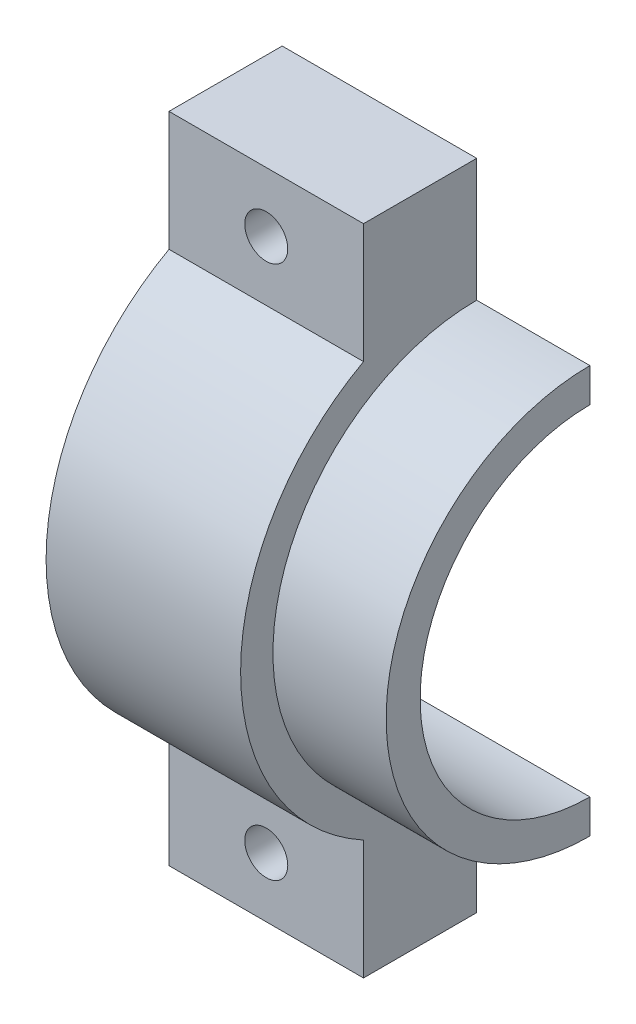
ISO-10303-21;
HEADER;
FILE_DESCRIPTION(('STEP AP214'),'2;1');
FILE_NAME('part.step','',(''),(''),'','','');
FILE_SCHEMA(('AUTOMOTIVE_DESIGN { 1 0 10303 214 1 1 1 1 }'));
ENDSEC;
DATA;
#1=APPLICATION_CONTEXT('core data for automotive mechanical design processes');
#2=APPLICATION_PROTOCOL_DEFINITION('international standard','automotive_design',2000,#1);
#3=PRODUCT_CONTEXT('',#1,'mechanical');
#4=PRODUCT('Part','Part','',(#3));
#5=PRODUCT_RELATED_PRODUCT_CATEGORY('part','',(#4));
#6=PRODUCT_DEFINITION_FORMATION('','',#4);
#7=PRODUCT_DEFINITION_CONTEXT('part definition',#1,'design');
#8=PRODUCT_DEFINITION('design','',#6,#7);
#9=PRODUCT_DEFINITION_SHAPE('','',#8);
#10=(LENGTH_UNIT() NAMED_UNIT(*) SI_UNIT(.MILLI.,.METRE.));
#11=(NAMED_UNIT(*) PLANE_ANGLE_UNIT() SI_UNIT($,.RADIAN.));
#12=(NAMED_UNIT(*) SI_UNIT($,.STERADIAN.) SOLID_ANGLE_UNIT());
#13=UNCERTAINTY_MEASURE_WITH_UNIT(LENGTH_MEASURE(1.E-05),#10,'distance_accuracy_value','');
#14=(GEOMETRIC_REPRESENTATION_CONTEXT(3) GLOBAL_UNCERTAINTY_ASSIGNED_CONTEXT((#13)) GLOBAL_UNIT_ASSIGNED_CONTEXT((#10,
#11,#12)) REPRESENTATION_CONTEXT('',''));
#15=CARTESIAN_POINT('',(0.,0.,0.));
#16=DIRECTION('',(0.,0.,1.));
#17=DIRECTION('',(1.,0.,0.));
#18=AXIS2_PLACEMENT_3D('',#15,#16,#17);
#19=CARTESIAN_POINT('',(0.,0.,163.846851175087));
#20=DIRECTION('',(0.,0.,1.));
#21=DIRECTION('',(1.,0.,0.));
#22=AXIS2_PLACEMENT_3D('',#19,#20,#21);
#23=PLANE('',#22);
#24=DIRECTION('',(0.,-1.,0.));
#25=VECTOR('',#24,1.);
#26=CARTESIAN_POINT('',(-13.7259035903398,0.,163.846851175087));
#27=LINE('',#26,#25);
#28=CARTESIAN_POINT('',(-13.7259035903398,-13.6244623370826,163.846851175087));
#29=VERTEX_POINT('',#28);
#30=CARTESIAN_POINT('',(-13.7259035903398,-17.4344623370826,163.846851175087));
#31=VERTEX_POINT('',#30);
#32=EDGE_CURVE('E46',#29,#31,#27,.T.);
#33=ORIENTED_EDGE('',*,*,#32,.T.);
#34=DIRECTION('',(1.,0.,0.));
#35=VECTOR('',#34,1.);
#36=CARTESIAN_POINT('',(-44.2059035903398,-17.4344623370826,163.846851175087));
#37=LINE('',#36,#35);
#38=CARTESIAN_POINT('',(-44.2059035903398,-17.4344623370826,163.846851175087));
#39=VERTEX_POINT('',#38);
#40=EDGE_CURVE('E308',#39,#31,#37,.T.);
#41=ORIENTED_EDGE('',*,*,#40,.F.);
#42=DIRECTION('',(0.,-1.,0.));
#43=VECTOR('',#42,1.);
#44=CARTESIAN_POINT('',(-44.2059035903398,-36.4844623370826,163.846851175087));
#45=LINE('',#44,#43);
#46=CARTESIAN_POINT('',(-44.2059035903398,-21.9969623370826,163.846851175087));
#47=VERTEX_POINT('',#46);
#48=EDGE_CURVE('E242',#39,#47,#45,.T.);
#49=ORIENTED_EDGE('',*,*,#48,.T.);
#50=DIRECTION('',(-1.,0.,0.));
#51=VECTOR('',#50,1.);
#52=CARTESIAN_POINT('',(-48.2509035903399,-21.9969623370826,163.846851175087));
#53=LINE('',#52,#51);
#54=CARTESIAN_POINT('',(-50.1959728523399,-21.9969623370826,163.846851175087));
#55=VERTEX_POINT('',#54);
#56=EDGE_CURVE('E320',#55,#47,#53,.F.);
#57=ORIENTED_EDGE('',*,*,#56,.F.);
#58=DIRECTION('',(0.,1.,0.));
#59=VECTOR('',#58,1.);
#60=CARTESIAN_POINT('',(-50.1959728523399,-36.4844623370826,163.846851175087));
#61=LINE('',#60,#59);
#62=CARTESIAN_POINT('',(-50.1959728523399,-18.7044623370826,163.846851175087));
#63=VERTEX_POINT('',#62);
#64=EDGE_CURVE('E248',#55,#63,#61,.T.);
#65=ORIENTED_EDGE('',*,*,#64,.T.);
#66=DIRECTION('',(1.,0.,0.));
#67=VECTOR('',#66,1.);
#68=CARTESIAN_POINT('',(-50.1959728523399,-18.7044623370826,163.846851175087));
#69=LINE('',#68,#67);
#70=CARTESIAN_POINT('',(-48.2509035903399,-18.7044623370826,163.846851175087));
#71=VERTEX_POINT('',#70);
#72=EDGE_CURVE('E161',#71,#63,#69,.F.);
#73=ORIENTED_EDGE('',*,*,#72,.F.);
#74=DIRECTION('',(0.,-1.,0.));
#75=VECTOR('',#74,1.);
#76=CARTESIAN_POINT('',(-48.2509035903399,-36.4844623370826,163.846851175087));
#77=LINE('',#76,#75);
#78=CARTESIAN_POINT('',(-48.2509035903399,0.163037662917389,163.846851175087));
#79=VERTEX_POINT('',#78);
#80=EDGE_CURVE('E332',#79,#71,#77,.T.);
#81=ORIENTED_EDGE('',*,*,#80,.F.);
#82=DIRECTION('',(1.,0.,0.));
#83=VECTOR('',#82,1.);
#84=CARTESIAN_POINT('',(-76.9703337735102,0.163037662917389,163.846851175087));
#85=LINE('',#84,#83);
#86=CARTESIAN_POINT('',(-26.4259035903398,0.163037662917389,163.846851175087));
#87=VERTEX_POINT('',#86);
#88=EDGE_CURVE('E255',#79,#87,#85,.T.);
#89=ORIENTED_EDGE('',*,*,#88,.T.);
#90=DIRECTION('',(0.,-1.,0.));
#91=VECTOR('',#90,1.);
#92=CARTESIAN_POINT('',(-26.4259035903398,-36.4844623370826,163.846851175087));
#93=LINE('',#92,#91);
#94=CARTESIAN_POINT('',(-26.4259035903398,-13.6244623370826,163.846851175087));
#95=VERTEX_POINT('',#94);
#96=EDGE_CURVE('E154',#87,#95,#93,.T.);
#97=ORIENTED_EDGE('',*,*,#96,.T.);
#98=DIRECTION('',(-1.,0.,0.));
#99=VECTOR('',#98,1.);
#100=CARTESIAN_POINT('',(-1.02590359033981,-13.6244623370826,163.846851175087));
#101=LINE('',#100,#99);
#102=EDGE_CURVE('E148',#29,#95,#101,.T.);
#103=ORIENTED_EDGE('',*,*,#102,.F.);
#104=EDGE_LOOP('',(#33,#41,#49,#57,#65,#73,#81,#89,#97,#103));
#105=FACE_BOUND('',#104,.T.);
#106=CARTESIAN_POINT('',(-37.3384035903399,-6.53856046823749,163.846851175087));
#107=DIRECTION('',(0.,0.,1.));
#108=DIRECTION('',(1.,0.,0.));
#109=AXIS2_PLACEMENT_3D('',#106,#107,#108);
#110=CIRCLE('',#109,2.413);
#111=CARTESIAN_POINT('',(-34.9254035903399,-6.53856046823749,163.846851175087));
#112=VERTEX_POINT('',#111);
#113=EDGE_CURVE('E224',#112,#112,#110,.F.);
#114=ORIENTED_EDGE('',*,*,#113,.F.);
#115=EDGE_LOOP('',(#114));
#116=FACE_BOUND('',#115,.T.);
#117=ADVANCED_FACE('F43',(#105,#116),#23,.F.);
#118=CARTESIAN_POINT('',(-37.3384035903399,-66.4303641739277,163.846851175087));
#119=DIRECTION('',(0.,0.,1.));
#120=DIRECTION('',(1.,0.,0.));
#121=AXIS2_PLACEMENT_3D('',#118,#119,#120);
#122=CIRCLE('',#121,2.413);
#123=CARTESIAN_POINT('',(-34.9254035903399,-66.4303641739277,163.846851175087));
#124=VERTEX_POINT('',#123);
#125=EDGE_CURVE('E171',#124,#124,#122,.T.);
#126=ORIENTED_EDGE('',*,*,#125,.T.);
#127=EDGE_LOOP('',(#126));
#128=FACE_BOUND('',#127,.T.);
#129=DIRECTION('',(0.,-1.,0.));
#130=VECTOR('',#129,1.);
#131=CARTESIAN_POINT('',(-13.7259035903398,0.,163.846851175087));
#132=LINE('',#131,#130);
#133=CARTESIAN_POINT('',(-13.7259035903398,-55.5344623370826,163.846851175087));
#134=VERTEX_POINT('',#133);
#135=CARTESIAN_POINT('',(-13.7259035903398,-59.3444623370826,163.846851175087));
#136=VERTEX_POINT('',#135);
#137=EDGE_CURVE('E252',#134,#136,#132,.T.);
#138=ORIENTED_EDGE('',*,*,#137,.T.);
#139=DIRECTION('',(-1.,0.,0.));
#140=VECTOR('',#139,1.);
#141=CARTESIAN_POINT('',(-1.02590359033981,-59.3444623370826,163.846851175087));
#142=LINE('',#141,#140);
#143=CARTESIAN_POINT('',(-26.4259035903398,-59.3444623370826,163.846851175087));
#144=VERTEX_POINT('',#143);
#145=EDGE_CURVE('E160',#144,#136,#142,.F.);
#146=ORIENTED_EDGE('',*,*,#145,.F.);
#147=CARTESIAN_POINT('',(-26.4259035903398,-73.1319623370826,163.846851175087));
#148=VERTEX_POINT('',#147);
#149=EDGE_CURVE('E238',#144,#148,#93,.T.);
#150=ORIENTED_EDGE('',*,*,#149,.T.);
#151=DIRECTION('',(-1.,0.,0.));
#152=VECTOR('',#151,1.);
#153=CARTESIAN_POINT('',(-76.9703337735102,-73.1319623370826,163.846851175087));
#154=LINE('',#153,#152);
#155=CARTESIAN_POINT('',(-48.2509035903399,-73.1319623370826,163.846851175087));
#156=VERTEX_POINT('',#155);
#157=EDGE_CURVE('E258',#148,#156,#154,.T.);
#158=ORIENTED_EDGE('',*,*,#157,.T.);
#159=CARTESIAN_POINT('',(-48.2509035903399,-54.2644623370826,163.846851175087));
#160=VERTEX_POINT('',#159);
#161=EDGE_CURVE('E325',#160,#156,#77,.T.);
#162=ORIENTED_EDGE('',*,*,#161,.F.);
#163=DIRECTION('',(1.,0.,0.));
#164=VECTOR('',#163,1.);
#165=CARTESIAN_POINT('',(-50.1959728523399,-54.2644623370826,163.846851175087));
#166=LINE('',#165,#164);
#167=CARTESIAN_POINT('',(-50.1959728523399,-54.2644623370826,163.846851175087));
#168=VERTEX_POINT('',#167);
#169=EDGE_CURVE('E319',#168,#160,#166,.T.);
#170=ORIENTED_EDGE('',*,*,#169,.F.);
#171=CARTESIAN_POINT('',(-50.1959728523399,-50.9719623370826,163.846851175087));
#172=VERTEX_POINT('',#171);
#173=EDGE_CURVE('E247',#168,#172,#61,.T.);
#174=ORIENTED_EDGE('',*,*,#173,.T.);
#175=DIRECTION('',(-1.,0.,0.));
#176=VECTOR('',#175,1.);
#177=CARTESIAN_POINT('',(-48.2509035903399,-50.9719623370826,163.846851175087));
#178=LINE('',#177,#176);
#179=CARTESIAN_POINT('',(-44.2059035903398,-50.9719623370826,163.846851175087));
#180=VERTEX_POINT('',#179);
#181=EDGE_CURVE('E313',#180,#172,#178,.T.);
#182=ORIENTED_EDGE('',*,*,#181,.F.);
#183=CARTESIAN_POINT('',(-44.2059035903398,-55.5344623370826,163.846851175087));
#184=VERTEX_POINT('',#183);
#185=EDGE_CURVE('E243',#180,#184,#45,.T.);
#186=ORIENTED_EDGE('',*,*,#185,.T.);
#187=DIRECTION('',(1.,0.,0.));
#188=VECTOR('',#187,1.);
#189=CARTESIAN_POINT('',(-44.2059035903398,-55.5344623370826,163.846851175087));
#190=LINE('',#189,#188);
#191=EDGE_CURVE('E309',#134,#184,#190,.F.);
#192=ORIENTED_EDGE('',*,*,#191,.F.);
#193=EDGE_LOOP('',(#138,#146,#150,#158,#162,#170,#174,#182,#186,#192));
#194=FACE_BOUND('',#193,.T.);
#195=ADVANCED_FACE('F265',(#128,#194),#23,.F.);
#196=CARTESIAN_POINT('',(-48.2509035903399,-36.4844623370826,163.846851175087));
#197=DIRECTION('',(1.,0.,0.));
#198=DIRECTION('',(0.,0.,-1.));
#199=AXIS2_PLACEMENT_3D('',#196,#197,#198);
#200=CYLINDRICAL_SURFACE('',#199,26.4875);
#201=CARTESIAN_POINT('',(-48.2509035903399,-36.4844623370826,163.846851175087));
#202=DIRECTION('',(1.,0.,0.));
#203=DIRECTION('',(0.,0.,-1.));
#204=AXIS2_PLACEMENT_3D('',#201,#202,#203);
#205=CIRCLE('',#204,26.4875);
#206=CARTESIAN_POINT('',(-48.2509035903399,-13.2401585993924,176.546851175087));
#207=VERTEX_POINT('',#206);
#208=CARTESIAN_POINT('',(-48.2509035903399,-59.7287660747728,176.546851175087));
#209=VERTEX_POINT('',#208);
#210=EDGE_CURVE('E285',#207,#209,#205,.T.);
#211=ORIENTED_EDGE('',*,*,#210,.T.);
#212=DIRECTION('',(1.,0.,0.));
#213=VECTOR('',#212,1.);
#214=CARTESIAN_POINT('',(-76.9703337735102,-59.7287660747728,176.546851175087));
#215=LINE('',#214,#213);
#216=CARTESIAN_POINT('',(-26.4259035903398,-59.7287660747728,176.546851175087));
#217=VERTEX_POINT('',#216);
#218=EDGE_CURVE('E204',#209,#217,#215,.T.);
#219=ORIENTED_EDGE('',*,*,#218,.T.);
#220=CARTESIAN_POINT('',(-26.4259035903398,-36.4844623370826,163.846851175087));
#221=DIRECTION('',(1.,0.,0.));
#222=DIRECTION('',(0.,0.,-1.));
#223=AXIS2_PLACEMENT_3D('',#220,#221,#222);
#224=CIRCLE('',#223,26.4875);
#225=CARTESIAN_POINT('',(-26.4259035903398,-13.2401585993924,176.546851175087));
#226=VERTEX_POINT('',#225);
#227=EDGE_CURVE('E283',#226,#217,#224,.T.);
#228=ORIENTED_EDGE('',*,*,#227,.F.);
#229=DIRECTION('',(1.,0.,0.));
#230=VECTOR('',#229,1.);
#231=CARTESIAN_POINT('',(-76.9703337735102,-13.2401585993924,176.546851175087));
#232=LINE('',#231,#230);
#233=EDGE_CURVE('E188',#207,#226,#232,.T.);
#234=ORIENTED_EDGE('',*,*,#233,.F.);
#235=EDGE_LOOP('',(#211,#219,#228,#234));
#236=FACE_BOUND('',#235,.T.);
#237=ADVANCED_FACE('F282',(#236),#200,.T.);
#238=CARTESIAN_POINT('',(-48.2509035903399,-36.4844623370826,163.846851175087));
#239=DIRECTION('',(-1.,0.,0.));
#240=DIRECTION('',(0.,0.,1.));
#241=AXIS2_PLACEMENT_3D('',#238,#239,#240);
#242=CYLINDRICAL_SURFACE('',#241,14.4875);
#243=CARTESIAN_POINT('',(-50.1959728523399,-36.4844623370826,163.846851175087));
#244=DIRECTION('',(-1.,0.,0.));
#245=DIRECTION('',(0.,0.,1.));
#246=AXIS2_PLACEMENT_3D('',#243,#244,#245);
#247=CIRCLE('',#246,14.4875);
#248=EDGE_CURVE('E229',#172,#55,#247,.T.);
#249=ORIENTED_EDGE('',*,*,#248,.T.);
#250=ORIENTED_EDGE('',*,*,#56,.T.);
#251=CARTESIAN_POINT('',(-44.2059035903398,-36.4844623370826,163.846851175087));
#252=DIRECTION('',(1.,0.,0.));
#253=DIRECTION('',(0.,0.,-1.));
#254=AXIS2_PLACEMENT_3D('',#251,#252,#253);
#255=CIRCLE('',#254,14.4875);
#256=EDGE_CURVE('E290',#180,#47,#255,.F.);
#257=ORIENTED_EDGE('',*,*,#256,.F.);
#258=ORIENTED_EDGE('',*,*,#181,.T.);
#259=EDGE_LOOP('',(#249,#250,#257,#258));
#260=FACE_BOUND('',#259,.T.);
#261=ADVANCED_FACE('F322',(#260),#242,.F.);
#262=CARTESIAN_POINT('',(-76.9703337735102,0.,176.546851175087));
#263=DIRECTION('',(0.,0.,-1.));
#264=DIRECTION('',(-1.,0.,0.));
#265=AXIS2_PLACEMENT_3D('',#262,#263,#264);
#266=PLANE('',#265);
#267=CARTESIAN_POINT('',(-37.3384035903399,-6.53856046823749,176.546851175087));
#268=DIRECTION('',(0.,0.,1.));
#269=DIRECTION('',(1.,0.,0.));
#270=AXIS2_PLACEMENT_3D('',#267,#268,#269);
#271=CIRCLE('',#270,2.413);
#272=CARTESIAN_POINT('',(-34.9254035903399,-6.53856046823749,176.546851175087));
#273=VERTEX_POINT('',#272);
#274=EDGE_CURVE('E52',#273,#273,#271,.T.);
#275=ORIENTED_EDGE('',*,*,#274,.F.);
#276=EDGE_LOOP('',(#275));
#277=FACE_BOUND('',#276,.T.);
#278=DIRECTION('',(1.,0.,0.));
#279=VECTOR('',#278,1.);
#280=CARTESIAN_POINT('',(-76.9703337735102,0.163037662917388,176.546851175087));
#281=LINE('',#280,#279);
#282=CARTESIAN_POINT('',(-48.2509035903399,0.163037662917388,176.546851175087));
#283=VERTEX_POINT('',#282);
#284=CARTESIAN_POINT('',(-26.4259035903398,0.163037662917388,176.546851175087));
#285=VERTEX_POINT('',#284);
#286=EDGE_CURVE('E193',#283,#285,#281,.T.);
#287=ORIENTED_EDGE('',*,*,#286,.F.);
#288=DIRECTION('',(0.,-1.,0.));
#289=VECTOR('',#288,1.);
#290=CARTESIAN_POINT('',(-48.2509035903399,0.,176.546851175087));
#291=LINE('',#290,#289);
#292=EDGE_CURVE('E176',#283,#207,#291,.T.);
#293=ORIENTED_EDGE('',*,*,#292,.T.);
#294=ORIENTED_EDGE('',*,*,#233,.T.);
#295=DIRECTION('',(0.,1.,0.));
#296=VECTOR('',#295,1.);
#297=CARTESIAN_POINT('',(-26.4259035903398,0.,176.546851175087));
#298=LINE('',#297,#296);
#299=EDGE_CURVE('E197',#226,#285,#298,.T.);
#300=ORIENTED_EDGE('',*,*,#299,.T.);
#301=EDGE_LOOP('',(#287,#293,#294,#300));
#302=FACE_BOUND('',#301,.T.);
#303=ADVANCED_FACE('F363',(#277,#302),#266,.F.);
#304=CARTESIAN_POINT('',(-37.3384035903399,-6.53856046823749,144.321856523074));
#305=DIRECTION('',(0.,0.,1.));
#306=DIRECTION('',(1.,0.,0.));
#307=AXIS2_PLACEMENT_3D('',#304,#305,#306);
#308=CYLINDRICAL_SURFACE('',#307,2.413);
#309=ORIENTED_EDGE('',*,*,#113,.T.);
#310=EDGE_LOOP('',(#309));
#311=FACE_BOUND('',#310,.T.);
#312=ORIENTED_EDGE('',*,*,#274,.T.);
#313=EDGE_LOOP('',(#312));
#314=FACE_BOUND('',#313,.T.);
#315=ADVANCED_FACE('F365',(#311,#314),#308,.F.);
#316=CARTESIAN_POINT('',(-48.2509035903399,-36.4844623370826,163.846851175087));
#317=DIRECTION('',(1.,0.,0.));
#318=DIRECTION('',(0.,0.,-1.));
#319=AXIS2_PLACEMENT_3D('',#316,#317,#318);
#320=PLANE('',#319);
#321=DIRECTION('',(0.,0.,-1.));
#322=VECTOR('',#321,1.);
#323=CARTESIAN_POINT('',(-48.2509035903399,0.163037662917409,0.));
#324=LINE('',#323,#322);
#325=EDGE_CURVE('E181',#283,#79,#324,.T.);
#326=ORIENTED_EDGE('',*,*,#325,.T.);
#327=ORIENTED_EDGE('',*,*,#80,.T.);
#328=CARTESIAN_POINT('',(-48.2509035903399,-36.4844623370826,163.846851175087));
#329=DIRECTION('',(1.,0.,0.));
#330=DIRECTION('',(0.,0.,-1.));
#331=AXIS2_PLACEMENT_3D('',#328,#329,#330);
#332=CIRCLE('',#331,17.78);
#333=EDGE_CURVE('E296',#160,#71,#332,.F.);
#334=ORIENTED_EDGE('',*,*,#333,.F.);
#335=ORIENTED_EDGE('',*,*,#161,.T.);
#336=DIRECTION('',(0.,0.,1.));
#337=VECTOR('',#336,1.);
#338=CARTESIAN_POINT('',(-48.2509035903399,-73.1319623370826,0.));
#339=LINE('',#338,#337);
#340=CARTESIAN_POINT('',(-48.2509035903399,-73.1319623370826,176.546851175087));
#341=VERTEX_POINT('',#340);
#342=EDGE_CURVE('E68',#156,#341,#339,.T.);
#343=ORIENTED_EDGE('',*,*,#342,.T.);
#344=DIRECTION('',(0.,-1.,0.));
#345=VECTOR('',#344,1.);
#346=CARTESIAN_POINT('',(-48.2509035903399,0.,176.546851175087));
#347=LINE('',#346,#345);
#348=EDGE_CURVE('E210',#209,#341,#347,.T.);
#349=ORIENTED_EDGE('',*,*,#348,.F.);
#350=ORIENTED_EDGE('',*,*,#210,.F.);
#351=ORIENTED_EDGE('',*,*,#292,.F.);
#352=EDGE_LOOP('',(#326,#327,#334,#335,#343,#349,#350,#351));
#353=FACE_BOUND('',#352,.T.);
#354=ADVANCED_FACE('F277',(#353),#320,.F.);
#355=CARTESIAN_POINT('',(-76.9703337735102,0.,176.546851175087));
#356=DIRECTION('',(0.,0.,-1.));
#357=DIRECTION('',(-1.,0.,0.));
#358=AXIS2_PLACEMENT_3D('',#355,#356,#357);
#359=PLANE('',#358);
#360=CARTESIAN_POINT('',(-37.3384035903399,-66.4303641739277,176.546851175087));
#361=DIRECTION('',(0.,0.,-1.));
#362=DIRECTION('',(1.,0.,0.));
#363=AXIS2_PLACEMENT_3D('',#360,#361,#362);
#364=CIRCLE('',#363,2.413);
#365=CARTESIAN_POINT('',(-34.9254035903399,-66.4303641739277,176.546851175087));
#366=VERTEX_POINT('',#365);
#367=EDGE_CURVE('E11',#366,#366,#364,.T.);
#368=ORIENTED_EDGE('',*,*,#367,.T.);
#369=EDGE_LOOP('',(#368));
#370=FACE_BOUND('',#369,.T.);
#371=ORIENTED_EDGE('',*,*,#218,.F.);
#372=ORIENTED_EDGE('',*,*,#348,.T.);
#373=DIRECTION('',(1.,0.,0.));
#374=VECTOR('',#373,1.);
#375=CARTESIAN_POINT('',(-76.9703337735102,-73.1319623370826,176.546851175087));
#376=LINE('',#375,#374);
#377=CARTESIAN_POINT('',(-26.4259035903398,-73.1319623370826,176.546851175087));
#378=VERTEX_POINT('',#377);
#379=EDGE_CURVE('E60',#341,#378,#376,.T.);
#380=ORIENTED_EDGE('',*,*,#379,.T.);
#381=DIRECTION('',(0.,1.,0.));
#382=VECTOR('',#381,1.);
#383=CARTESIAN_POINT('',(-26.4259035903398,0.,176.546851175087));
#384=LINE('',#383,#382);
#385=EDGE_CURVE('E207',#378,#217,#384,.T.);
#386=ORIENTED_EDGE('',*,*,#385,.T.);
#387=EDGE_LOOP('',(#371,#372,#380,#386));
#388=FACE_BOUND('',#387,.T.);
#389=ADVANCED_FACE('F272',(#370,#388),#359,.F.);
#390=CARTESIAN_POINT('',(-37.3384035903399,-66.4303641739277,144.321856523074));
#391=DIRECTION('',(0.,0.,1.));
#392=DIRECTION('',(0.,-1.,0.));
#393=AXIS2_PLACEMENT_3D('',#390,#391,#392);
#394=CYLINDRICAL_SURFACE('',#393,2.413);
#395=ORIENTED_EDGE('',*,*,#125,.F.);
#396=EDGE_LOOP('',(#395));
#397=FACE_BOUND('',#396,.T.);
#398=ORIENTED_EDGE('',*,*,#367,.F.);
#399=EDGE_LOOP('',(#398));
#400=FACE_BOUND('',#399,.T.);
#401=ADVANCED_FACE('F268',(#397,#400),#394,.F.);
#402=CARTESIAN_POINT('',(-26.4259035903398,-36.4844623370826,163.846851175087));
#403=DIRECTION('',(1.,0.,0.));
#404=DIRECTION('',(0.,0.,-1.));
#405=AXIS2_PLACEMENT_3D('',#402,#403,#404);
#406=PLANE('',#405);
#407=ORIENTED_EDGE('',*,*,#96,.F.);
#408=DIRECTION('',(0.,0.,1.));
#409=VECTOR('',#408,1.);
#410=CARTESIAN_POINT('',(-26.4259035903398,0.163037662917409,0.));
#411=LINE('',#410,#409);
#412=EDGE_CURVE('E192',#87,#285,#411,.T.);
#413=ORIENTED_EDGE('',*,*,#412,.T.);
#414=ORIENTED_EDGE('',*,*,#299,.F.);
#415=ORIENTED_EDGE('',*,*,#227,.T.);
#416=ORIENTED_EDGE('',*,*,#385,.F.);
#417=DIRECTION('',(0.,0.,-1.));
#418=VECTOR('',#417,1.);
#419=CARTESIAN_POINT('',(-26.4259035903398,-73.1319623370826,0.));
#420=LINE('',#419,#418);
#421=EDGE_CURVE('E213',#378,#148,#420,.T.);
#422=ORIENTED_EDGE('',*,*,#421,.T.);
#423=ORIENTED_EDGE('',*,*,#149,.F.);
#424=CARTESIAN_POINT('',(-26.4259035903398,-36.4844623370826,163.846851175087));
#425=DIRECTION('',(1.,0.,0.));
#426=DIRECTION('',(0.,0.,-1.));
#427=AXIS2_PLACEMENT_3D('',#424,#425,#426);
#428=CIRCLE('',#427,22.86);
#429=EDGE_CURVE('E183',#95,#144,#428,.T.);
#430=ORIENTED_EDGE('',*,*,#429,.F.);
#431=EDGE_LOOP('',(#407,#413,#414,#415,#416,#422,#423,#430));
#432=FACE_BOUND('',#431,.T.);
#433=ADVANCED_FACE('F271',(#432),#406,.T.);
#434=CARTESIAN_POINT('',(-76.9703337735102,-73.1319623370826,0.));
#435=DIRECTION('',(0.,-1.,0.));
#436=DIRECTION('',(0.,0.,-1.));
#437=AXIS2_PLACEMENT_3D('',#434,#435,#436);
#438=PLANE('',#437);
#439=ORIENTED_EDGE('',*,*,#157,.F.);
#440=ORIENTED_EDGE('',*,*,#421,.F.);
#441=ORIENTED_EDGE('',*,*,#379,.F.);
#442=ORIENTED_EDGE('',*,*,#342,.F.);
#443=EDGE_LOOP('',(#439,#440,#441,#442));
#444=FACE_BOUND('',#443,.T.);
#445=ADVANCED_FACE('F356',(#444),#438,.T.);
#446=CARTESIAN_POINT('',(-76.9703337735102,0.163037662917409,0.));
#447=DIRECTION('',(0.,1.,0.));
#448=DIRECTION('',(0.,0.,1.));
#449=AXIS2_PLACEMENT_3D('',#446,#447,#448);
#450=PLANE('',#449);
#451=ORIENTED_EDGE('',*,*,#88,.F.);
#452=ORIENTED_EDGE('',*,*,#325,.F.);
#453=ORIENTED_EDGE('',*,*,#286,.T.);
#454=ORIENTED_EDGE('',*,*,#412,.F.);
#455=EDGE_LOOP('',(#451,#452,#453,#454));
#456=FACE_BOUND('',#455,.T.);
#457=ADVANCED_FACE('F360',(#456),#450,.T.);
#458=CARTESIAN_POINT('',(-1.02590359033981,-36.4844623370826,163.846851175087));
#459=DIRECTION('',(-1.,0.,0.));
#460=DIRECTION('',(0.,0.,1.));
#461=AXIS2_PLACEMENT_3D('',#458,#459,#460);
#462=CYLINDRICAL_SURFACE('',#461,22.86);
#463=CARTESIAN_POINT('',(-13.7259035903398,-36.4844623370826,163.846851175087));
#464=DIRECTION('',(1.,0.,0.));
#465=DIRECTION('',(0.,0.,-1.));
#466=AXIS2_PLACEMENT_3D('',#463,#464,#465);
#467=CIRCLE('',#466,22.86);
#468=EDGE_CURVE('E167',#29,#136,#467,.T.);
#469=ORIENTED_EDGE('',*,*,#468,.F.);
#470=ORIENTED_EDGE('',*,*,#102,.T.);
#471=ORIENTED_EDGE('',*,*,#429,.T.);
#472=ORIENTED_EDGE('',*,*,#145,.T.);
#473=EDGE_LOOP('',(#469,#470,#471,#472));
#474=FACE_BOUND('',#473,.T.);
#475=ADVANCED_FACE('F172',(#474),#462,.T.);
#476=CARTESIAN_POINT('',(-44.2059035903398,-36.4844623370826,163.846851175087));
#477=DIRECTION('',(1.,0.,0.));
#478=DIRECTION('',(0.,0.,-1.));
#479=AXIS2_PLACEMENT_3D('',#476,#477,#478);
#480=CYLINDRICAL_SURFACE('',#479,19.05);
#481=CARTESIAN_POINT('',(-13.7259035903398,-36.4844623370826,163.846851175087));
#482=DIRECTION('',(1.,0.,0.));
#483=DIRECTION('',(0.,0.,-1.));
#484=AXIS2_PLACEMENT_3D('',#481,#482,#483);
#485=CIRCLE('',#484,19.05);
#486=EDGE_CURVE('E169',#134,#31,#485,.F.);
#487=ORIENTED_EDGE('',*,*,#486,.F.);
#488=ORIENTED_EDGE('',*,*,#191,.T.);
#489=CARTESIAN_POINT('',(-44.2059035903398,-36.4844623370826,163.846851175087));
#490=DIRECTION('',(1.,0.,0.));
#491=DIRECTION('',(0.,0.,-1.));
#492=AXIS2_PLACEMENT_3D('',#489,#490,#491);
#493=CIRCLE('',#492,19.05);
#494=EDGE_CURVE('E236',#39,#184,#493,.T.);
#495=ORIENTED_EDGE('',*,*,#494,.F.);
#496=ORIENTED_EDGE('',*,*,#40,.T.);
#497=EDGE_LOOP('',(#487,#488,#495,#496));
#498=FACE_BOUND('',#497,.T.);
#499=ADVANCED_FACE('F307',(#498),#480,.F.);
#500=CARTESIAN_POINT('',(-13.7259035903398,0.,0.));
#501=DIRECTION('',(1.,0.,0.));
#502=DIRECTION('',(0.,0.,-1.));
#503=AXIS2_PLACEMENT_3D('',#500,#501,#502);
#504=PLANE('',#503);
#505=ORIENTED_EDGE('',*,*,#137,.F.);
#506=ORIENTED_EDGE('',*,*,#486,.T.);
#507=ORIENTED_EDGE('',*,*,#32,.F.);
#508=ORIENTED_EDGE('',*,*,#468,.T.);
#509=EDGE_LOOP('',(#505,#506,#507,#508));
#510=FACE_BOUND('',#509,.T.);
#511=ADVANCED_FACE('F166',(#510),#504,.T.);
#512=CARTESIAN_POINT('',(-50.1959728523399,-36.4844623370826,163.846851175087));
#513=DIRECTION('',(-1.,0.,0.));
#514=DIRECTION('',(0.,0.,1.));
#515=AXIS2_PLACEMENT_3D('',#512,#513,#514);
#516=PLANE('',#515);
#517=ORIENTED_EDGE('',*,*,#173,.F.);
#518=CARTESIAN_POINT('',(-50.1959728523399,-36.4844623370826,163.846851175087));
#519=DIRECTION('',(-1.,0.,0.));
#520=DIRECTION('',(0.,0.,1.));
#521=AXIS2_PLACEMENT_3D('',#518,#519,#520);
#522=CIRCLE('',#521,17.78);
#523=EDGE_CURVE('E233',#168,#63,#522,.T.);
#524=ORIENTED_EDGE('',*,*,#523,.T.);
#525=ORIENTED_EDGE('',*,*,#64,.F.);
#526=ORIENTED_EDGE('',*,*,#248,.F.);
#527=EDGE_LOOP('',(#517,#524,#525,#526));
#528=FACE_BOUND('',#527,.T.);
#529=ADVANCED_FACE('F354',(#528),#516,.T.);
#530=CARTESIAN_POINT('',(-50.1959728523399,-36.4844623370826,163.846851175087));
#531=DIRECTION('',(1.,0.,0.));
#532=DIRECTION('',(0.,0.,-1.));
#533=AXIS2_PLACEMENT_3D('',#530,#531,#532);
#534=CYLINDRICAL_SURFACE('',#533,17.78);
#535=ORIENTED_EDGE('',*,*,#523,.F.);
#536=ORIENTED_EDGE('',*,*,#169,.T.);
#537=ORIENTED_EDGE('',*,*,#333,.T.);
#538=ORIENTED_EDGE('',*,*,#72,.T.);
#539=EDGE_LOOP('',(#535,#536,#537,#538));
#540=FACE_BOUND('',#539,.T.);
#541=ADVANCED_FACE('F348',(#540),#534,.T.);
#542=CARTESIAN_POINT('',(-44.2059035903398,-36.4844623370826,163.846851175087));
#543=DIRECTION('',(1.,0.,0.));
#544=DIRECTION('',(0.,0.,-1.));
#545=AXIS2_PLACEMENT_3D('',#542,#543,#544);
#546=PLANE('',#545);
#547=ORIENTED_EDGE('',*,*,#48,.F.);
#548=ORIENTED_EDGE('',*,*,#494,.T.);
#549=ORIENTED_EDGE('',*,*,#185,.F.);
#550=ORIENTED_EDGE('',*,*,#256,.T.);
#551=EDGE_LOOP('',(#547,#548,#549,#550));
#552=FACE_BOUND('',#551,.T.);
#553=ADVANCED_FACE('F303',(#552),#546,.T.);
#554=CLOSED_SHELL('',(#117,#195,#237,#261,#303,#315,#354,#389,#401,#433,#445,#457,#475,#499,
#511,#529,#541,#553));
#555=MANIFOLD_SOLID_BREP('B2',#554);
#556=ADVANCED_BREP_SHAPE_REPRESENTATION('',(#18,#555),#14);
#557=SHAPE_DEFINITION_REPRESENTATION(#9,#556);
ENDSEC;
END-ISO-10303-21;
